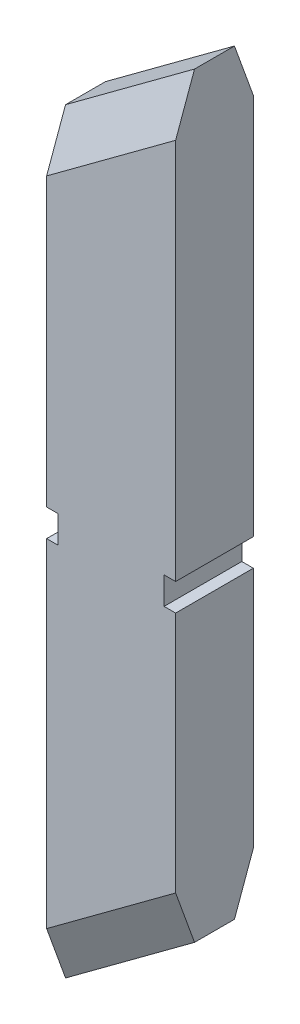
ISO-10303-21;
HEADER;
FILE_DESCRIPTION(('STEP AP214'),'2;1');
FILE_NAME('part.step','',(''),(''),'','','');
FILE_SCHEMA(('AUTOMOTIVE_DESIGN { 1 0 10303 214 1 1 1 1 }'));
ENDSEC;
DATA;
#1=APPLICATION_CONTEXT('core data for automotive mechanical design processes');
#2=APPLICATION_PROTOCOL_DEFINITION('international standard','automotive_design',2000,#1);
#3=PRODUCT_CONTEXT('',#1,'mechanical');
#4=PRODUCT('Part','Part','',(#3));
#5=PRODUCT_RELATED_PRODUCT_CATEGORY('part','',(#4));
#6=PRODUCT_DEFINITION_FORMATION('','',#4);
#7=PRODUCT_DEFINITION_CONTEXT('part definition',#1,'design');
#8=PRODUCT_DEFINITION('design','',#6,#7);
#9=PRODUCT_DEFINITION_SHAPE('','',#8);
#10=(LENGTH_UNIT() NAMED_UNIT(*) SI_UNIT(.MILLI.,.METRE.));
#11=(NAMED_UNIT(*) PLANE_ANGLE_UNIT() SI_UNIT($,.RADIAN.));
#12=(NAMED_UNIT(*) SI_UNIT($,.STERADIAN.) SOLID_ANGLE_UNIT());
#13=UNCERTAINTY_MEASURE_WITH_UNIT(LENGTH_MEASURE(1.E-05),#10,'distance_accuracy_value','');
#14=(GEOMETRIC_REPRESENTATION_CONTEXT(3) GLOBAL_UNCERTAINTY_ASSIGNED_CONTEXT((#13)) GLOBAL_UNIT_ASSIGNED_CONTEXT((#10,
#11,#12)) REPRESENTATION_CONTEXT('',''));
#15=CARTESIAN_POINT('',(0.,0.,0.));
#16=DIRECTION('',(0.,0.,1.));
#17=DIRECTION('',(1.,0.,0.));
#18=AXIS2_PLACEMENT_3D('',#15,#16,#17);
#19=CARTESIAN_POINT('',(2.93652173913044,23.3863043478261,3.7));
#20=DIRECTION('',(-1.,0.,0.));
#21=DIRECTION('',(0.,-1.,0.));
#22=AXIS2_PLACEMENT_3D('',#19,#20,#21);
#23=PLANE('',#22);
#24=DIRECTION('',(0.,0.,-1.));
#25=VECTOR('',#24,1.);
#26=CARTESIAN_POINT('',(2.93652173913044,2.71102614850869,59.784027911912));
#27=LINE('',#26,#25);
#28=CARTESIAN_POINT('',(2.93652173913044,2.71102614850869,3.7));
#29=VERTEX_POINT('',#28);
#30=CARTESIAN_POINT('',(2.93652173913044,2.71102614850869,0.));
#31=VERTEX_POINT('',#30);
#32=EDGE_CURVE('E174',#29,#31,#27,.T.);
#33=ORIENTED_EDGE('',*,*,#32,.T.);
#34=DIRECTION('',(0.,1.,0.));
#35=VECTOR('',#34,1.);
#36=CARTESIAN_POINT('',(2.93652173913044,23.3863043478261,0.));
#37=LINE('',#36,#35);
#38=CARTESIAN_POINT('',(2.93652173913044,20.8992870180739,0.));
#39=VERTEX_POINT('',#38);
#40=EDGE_CURVE('E208',#31,#39,#37,.T.);
#41=ORIENTED_EDGE('',*,*,#40,.T.);
#42=DIRECTION('',(0.,-0.9403229374053,-0.340283372190692));
#43=VECTOR('',#42,1.);
#44=CARTESIAN_POINT('',(2.93652173913044,23.3863043478261,0.900000000000001));
#45=LINE('',#44,#43);
#46=CARTESIAN_POINT('',(2.93652173913044,23.3863043478261,0.900000000000001));
#47=VERTEX_POINT('',#46);
#48=EDGE_CURVE('E240',#39,#47,#45,.F.);
#49=ORIENTED_EDGE('',*,*,#48,.T.);
#50=DIRECTION('',(0.,0.,-1.));
#51=VECTOR('',#50,1.);
#52=CARTESIAN_POINT('',(2.93652173913044,23.3863043478261,3.7));
#53=LINE('',#52,#51);
#54=CARTESIAN_POINT('',(2.93652173913044,23.3863043478261,2.8));
#55=VERTEX_POINT('',#54);
#56=EDGE_CURVE('E204',#55,#47,#53,.T.);
#57=ORIENTED_EDGE('',*,*,#56,.F.);
#58=DIRECTION('',(0.,-0.9403229374053,0.340283372190692));
#59=VECTOR('',#58,1.);
#60=CARTESIAN_POINT('',(2.93652173913044,13.1294252449321,6.51175185720331));
#61=LINE('',#60,#59);
#62=CARTESIAN_POINT('',(2.93652173913044,20.8992870180739,3.7));
#63=VERTEX_POINT('',#62);
#64=EDGE_CURVE('E229',#55,#63,#61,.T.);
#65=ORIENTED_EDGE('',*,*,#64,.T.);
#66=DIRECTION('',(0.,1.,0.));
#67=VECTOR('',#66,1.);
#68=CARTESIAN_POINT('',(2.93652173913044,23.3863043478261,3.7));
#69=LINE('',#68,#67);
#70=EDGE_CURVE('E200',#29,#63,#69,.T.);
#71=ORIENTED_EDGE('',*,*,#70,.F.);
#72=EDGE_LOOP('',(#33,#41,#49,#57,#65,#71));
#73=FACE_BOUND('',#72,.T.);
#74=ADVANCED_FACE('F39',(#73),#23,.F.);
#75=DIRECTION('',(0.,0.,-1.));
#76=VECTOR('',#75,1.);
#77=CARTESIAN_POINT('',(2.93652173913044,1.41102614850869,59.784027911912));
#78=LINE('',#77,#76);
#79=CARTESIAN_POINT('',(2.93652173913044,1.41102614850869,3.7));
#80=VERTEX_POINT('',#79);
#81=CARTESIAN_POINT('',(2.93652173913044,1.41102614850869,0.));
#82=VERTEX_POINT('',#81);
#83=EDGE_CURVE('E165',#80,#82,#78,.T.);
#84=ORIENTED_EDGE('',*,*,#83,.F.);
#85=CARTESIAN_POINT('',(2.93652173913044,-10.1266783224216,3.70000000000001));
#86=VERTEX_POINT('',#85);
#87=EDGE_CURVE('E202',#86,#80,#69,.T.);
#88=ORIENTED_EDGE('',*,*,#87,.F.);
#89=DIRECTION('',(0.,-0.9403229374053,-0.340283372190692));
#90=VECTOR('',#89,1.);
#91=CARTESIAN_POINT('',(2.93652173913044,-8.20430584182602,4.3956667377579));
#92=LINE('',#91,#90);
#93=CARTESIAN_POINT('',(2.93652173913044,-12.6136956521739,2.8));
#94=VERTEX_POINT('',#93);
#95=EDGE_CURVE('E245',#86,#94,#92,.T.);
#96=ORIENTED_EDGE('',*,*,#95,.T.);
#97=DIRECTION('',(0.,0.,-1.));
#98=VECTOR('',#97,1.);
#99=CARTESIAN_POINT('',(2.93652173913044,-12.6136956521739,3.7));
#100=LINE('',#99,#98);
#101=CARTESIAN_POINT('',(2.93652173913044,-12.6136956521739,0.899999999999998));
#102=VERTEX_POINT('',#101);
#103=EDGE_CURVE('E213',#94,#102,#100,.T.);
#104=ORIENTED_EDGE('',*,*,#103,.T.);
#105=DIRECTION('',(0.,-0.940322937405299,0.340283372190693));
#106=VECTOR('',#105,1.);
#107=CARTESIAN_POINT('',(2.93652173913044,-12.6136956521739,0.899999999999998));
#108=LINE('',#107,#106);
#109=CARTESIAN_POINT('',(2.93652173913044,-10.1266783224217,0.));
#110=VERTEX_POINT('',#109);
#111=EDGE_CURVE('E255',#102,#110,#108,.F.);
#112=ORIENTED_EDGE('',*,*,#111,.T.);
#113=EDGE_CURVE('E209',#110,#82,#37,.T.);
#114=ORIENTED_EDGE('',*,*,#113,.T.);
#115=EDGE_LOOP('',(#84,#88,#96,#104,#112,#114));
#116=FACE_BOUND('',#115,.T.);
#117=ADVANCED_FACE('F311',(#116),#23,.F.);
#118=CARTESIAN_POINT('',(0.,0.,3.7));
#119=DIRECTION('',(0.,0.,1.));
#120=DIRECTION('',(1.,0.,0.));
#121=AXIS2_PLACEMENT_3D('',#118,#119,#120);
#122=PLANE('',#121);
#123=DIRECTION('',(0.,1.,0.));
#124=VECTOR('',#123,1.);
#125=CARTESIAN_POINT('',(2.38652173913044,0.,3.7));
#126=LINE('',#125,#124);
#127=CARTESIAN_POINT('',(2.38652173913044,1.41102614850869,3.7));
#128=VERTEX_POINT('',#127);
#129=CARTESIAN_POINT('',(2.38652173913044,2.71102614850869,3.7));
#130=VERTEX_POINT('',#129);
#131=EDGE_CURVE('E54',#128,#130,#126,.T.);
#132=ORIENTED_EDGE('',*,*,#131,.T.);
#133=DIRECTION('',(1.,0.,0.));
#134=VECTOR('',#133,1.);
#135=CARTESIAN_POINT('',(0.,2.7110261485087,3.7));
#136=LINE('',#135,#134);
#137=EDGE_CURVE('E178',#130,#29,#136,.T.);
#138=ORIENTED_EDGE('',*,*,#137,.T.);
#139=ORIENTED_EDGE('',*,*,#70,.T.);
#140=DIRECTION('',(-0.804176141466327,-0.594391061083804,0.));
#141=VECTOR('',#140,1.);
#142=CARTESIAN_POINT('',(-2.01469613870194,17.2396911953282,3.7));
#143=LINE('',#142,#141);
#144=CARTESIAN_POINT('',(-3.20347826086956,16.3610261485087,3.7));
#145=VERTEX_POINT('',#144);
#146=EDGE_CURVE('E222',#63,#145,#143,.T.);
#147=ORIENTED_EDGE('',*,*,#146,.T.);
#148=DIRECTION('',(0.,-1.,0.));
#149=VECTOR('',#148,1.);
#150=CARTESIAN_POINT('',(-3.20347826086956,18.8480434782609,3.7));
#151=LINE('',#150,#149);
#152=CARTESIAN_POINT('',(-3.20347826086956,2.71102614850869,3.7));
#153=VERTEX_POINT('',#152);
#154=EDGE_CURVE('E197',#145,#153,#151,.T.);
#155=ORIENTED_EDGE('',*,*,#154,.T.);
#156=DIRECTION('',(-1.,0.,0.));
#157=VECTOR('',#156,1.);
#158=CARTESIAN_POINT('',(0.,2.71102614850869,3.7));
#159=LINE('',#158,#157);
#160=CARTESIAN_POINT('',(-2.65347826086956,2.71102614850869,3.7));
#161=VERTEX_POINT('',#160);
#162=EDGE_CURVE('E194',#161,#153,#159,.T.);
#163=ORIENTED_EDGE('',*,*,#162,.F.);
#164=DIRECTION('',(0.,1.,0.));
#165=VECTOR('',#164,1.);
#166=CARTESIAN_POINT('',(-2.65347826086956,0.,3.7));
#167=LINE('',#166,#165);
#168=CARTESIAN_POINT('',(-2.65347826086956,1.41102614850869,3.7));
#169=VERTEX_POINT('',#168);
#170=EDGE_CURVE('E192',#169,#161,#167,.T.);
#171=ORIENTED_EDGE('',*,*,#170,.F.);
#172=DIRECTION('',(1.,0.,0.));
#173=VECTOR('',#172,1.);
#174=CARTESIAN_POINT('',(0.,1.41102614850869,3.7));
#175=LINE('',#174,#173);
#176=CARTESIAN_POINT('',(-3.20347826086956,1.41102614850869,3.7));
#177=VERTEX_POINT('',#176);
#178=EDGE_CURVE('E190',#177,#169,#175,.T.);
#179=ORIENTED_EDGE('',*,*,#178,.F.);
#180=CARTESIAN_POINT('',(-3.20347826086956,-14.6649391919868,3.70000000000001));
#181=VERTEX_POINT('',#180);
#182=EDGE_CURVE('E201',#177,#181,#151,.T.);
#183=ORIENTED_EDGE('',*,*,#182,.T.);
#184=DIRECTION('',(0.804176141466327,0.594391061083804,0.));
#185=VECTOR('',#184,1.);
#186=CARTESIAN_POINT('',(1.74773961696281,-11.0053433692412,3.7));
#187=LINE('',#186,#185);
#188=EDGE_CURVE('E242',#181,#86,#187,.T.);
#189=ORIENTED_EDGE('',*,*,#188,.T.);
#190=ORIENTED_EDGE('',*,*,#87,.T.);
#191=DIRECTION('',(-1.,0.,0.));
#192=VECTOR('',#191,1.);
#193=CARTESIAN_POINT('',(0.,1.4110261485087,3.7));
#194=LINE('',#193,#192);
#195=EDGE_CURVE('E59',#80,#128,#194,.T.);
#196=ORIENTED_EDGE('',*,*,#195,.T.);
#197=EDGE_LOOP('',(#132,#138,#139,#147,#155,#163,#171,#179,#183,#189,#190,#196));
#198=FACE_BOUND('',#197,.T.);
#199=ADVANCED_FACE('F293',(#198),#122,.T.);
#200=CARTESIAN_POINT('',(0.,0.,0.));
#201=DIRECTION('',(0.,0.,1.));
#202=DIRECTION('',(1.,0.,0.));
#203=AXIS2_PLACEMENT_3D('',#200,#201,#202);
#204=PLANE('',#203);
#205=DIRECTION('',(1.,0.,0.));
#206=VECTOR('',#205,1.);
#207=CARTESIAN_POINT('',(0.,2.7110261485087,0.));
#208=LINE('',#207,#206);
#209=CARTESIAN_POINT('',(2.38652173913044,2.71102614850869,0.));
#210=VERTEX_POINT('',#209);
#211=EDGE_CURVE('E11',#210,#31,#208,.T.);
#212=ORIENTED_EDGE('',*,*,#211,.F.);
#213=DIRECTION('',(0.,1.,0.));
#214=VECTOR('',#213,1.);
#215=CARTESIAN_POINT('',(2.38652173913044,0.,0.));
#216=LINE('',#215,#214);
#217=CARTESIAN_POINT('',(2.38652173913044,1.41102614850869,0.));
#218=VERTEX_POINT('',#217);
#219=EDGE_CURVE('E47',#218,#210,#216,.T.);
#220=ORIENTED_EDGE('',*,*,#219,.F.);
#221=DIRECTION('',(-1.,0.,0.));
#222=VECTOR('',#221,1.);
#223=CARTESIAN_POINT('',(0.,1.4110261485087,0.));
#224=LINE('',#223,#222);
#225=EDGE_CURVE('E153',#82,#218,#224,.T.);
#226=ORIENTED_EDGE('',*,*,#225,.F.);
#227=ORIENTED_EDGE('',*,*,#113,.F.);
#228=DIRECTION('',(-0.804176141466327,-0.594391061083804,0.));
#229=VECTOR('',#228,1.);
#230=CARTESIAN_POINT('',(5.87797800327087,-7.95255847501356,0.));
#231=LINE('',#230,#229);
#232=CARTESIAN_POINT('',(-3.20347826086956,-14.6649391919869,0.));
#233=VERTEX_POINT('',#232);
#234=EDGE_CURVE('E257',#110,#233,#231,.T.);
#235=ORIENTED_EDGE('',*,*,#234,.T.);
#236=DIRECTION('',(0.,-1.,0.));
#237=VECTOR('',#236,1.);
#238=CARTESIAN_POINT('',(-3.20347826086956,18.8480434782609,0.));
#239=LINE('',#238,#237);
#240=CARTESIAN_POINT('',(-3.20347826086956,1.41102614850869,0.));
#241=VERTEX_POINT('',#240);
#242=EDGE_CURVE('E196',#241,#233,#239,.T.);
#243=ORIENTED_EDGE('',*,*,#242,.F.);
#244=DIRECTION('',(1.,0.,0.));
#245=VECTOR('',#244,1.);
#246=CARTESIAN_POINT('',(0.,1.41102614850869,0.));
#247=LINE('',#246,#245);
#248=CARTESIAN_POINT('',(-2.65347826086956,1.41102614850869,0.));
#249=VERTEX_POINT('',#248);
#250=EDGE_CURVE('E262',#241,#249,#247,.T.);
#251=ORIENTED_EDGE('',*,*,#250,.T.);
#252=DIRECTION('',(0.,1.,0.));
#253=VECTOR('',#252,1.);
#254=CARTESIAN_POINT('',(-2.65347826086956,0.,0.));
#255=LINE('',#254,#253);
#256=CARTESIAN_POINT('',(-2.65347826086956,2.71102614850869,0.));
#257=VERTEX_POINT('',#256);
#258=EDGE_CURVE('E265',#249,#257,#255,.T.);
#259=ORIENTED_EDGE('',*,*,#258,.T.);
#260=DIRECTION('',(-1.,0.,0.));
#261=VECTOR('',#260,1.);
#262=CARTESIAN_POINT('',(0.,2.71102614850869,0.));
#263=LINE('',#262,#261);
#264=CARTESIAN_POINT('',(-3.20347826086956,2.71102614850869,0.));
#265=VERTEX_POINT('',#264);
#266=EDGE_CURVE('E166',#257,#265,#263,.T.);
#267=ORIENTED_EDGE('',*,*,#266,.T.);
#268=CARTESIAN_POINT('',(-3.20347826086956,16.3610261485087,0.));
#269=VERTEX_POINT('',#268);
#270=EDGE_CURVE('E205',#269,#265,#239,.T.);
#271=ORIENTED_EDGE('',*,*,#270,.F.);
#272=DIRECTION('',(0.804176141466327,0.594391061083804,0.));
#273=VECTOR('',#272,1.);
#274=CARTESIAN_POINT('',(-8.95228171327408,12.1119105532532,0.));
#275=LINE('',#274,#273);
#276=EDGE_CURVE('E237',#269,#39,#275,.T.);
#277=ORIENTED_EDGE('',*,*,#276,.T.);
#278=ORIENTED_EDGE('',*,*,#40,.F.);
#279=EDGE_LOOP('',(#212,#220,#226,#227,#235,#243,#251,#259,#267,#271,#277,#278));
#280=FACE_BOUND('',#279,.T.);
#281=ADVANCED_FACE('F151',(#280),#204,.F.);
#282=CARTESIAN_POINT('',(-3.20347826086956,18.8480434782609,3.7));
#283=DIRECTION('',(1.,0.,0.));
#284=DIRECTION('',(0.,0.,-1.));
#285=AXIS2_PLACEMENT_3D('',#282,#283,#284);
#286=PLANE('',#285);
#287=ORIENTED_EDGE('',*,*,#270,.T.);
#288=DIRECTION('',(0.,0.,-1.));
#289=VECTOR('',#288,1.);
#290=CARTESIAN_POINT('',(-3.20347826086956,2.71102614850869,58.659027911912));
#291=LINE('',#290,#289);
#292=EDGE_CURVE('E188',#153,#265,#291,.T.);
#293=ORIENTED_EDGE('',*,*,#292,.F.);
#294=ORIENTED_EDGE('',*,*,#154,.F.);
#295=DIRECTION('',(0.,0.9403229374053,-0.340283372190692));
#296=VECTOR('',#295,1.);
#297=CARTESIAN_POINT('',(-3.20347826086956,12.6039274324803,5.05961611685371));
#298=LINE('',#297,#296);
#299=CARTESIAN_POINT('',(-3.20347826086956,18.8480434782609,2.8));
#300=VERTEX_POINT('',#299);
#301=EDGE_CURVE('E225',#145,#300,#298,.T.);
#302=ORIENTED_EDGE('',*,*,#301,.T.);
#303=DIRECTION('',(0.,0.,-1.));
#304=VECTOR('',#303,1.);
#305=CARTESIAN_POINT('',(-3.20347826086956,18.8480434782609,3.7));
#306=LINE('',#305,#304);
#307=CARTESIAN_POINT('',(-3.20347826086956,18.8480434782609,0.900000000000001));
#308=VERTEX_POINT('',#307);
#309=EDGE_CURVE('E219',#300,#308,#306,.T.);
#310=ORIENTED_EDGE('',*,*,#309,.T.);
#311=DIRECTION('',(0.,0.9403229374053,0.340283372190692));
#312=VECTOR('',#311,1.);
#313=CARTESIAN_POINT('',(-3.20347826086956,22.8608065353742,2.3521357403496));
#314=LINE('',#313,#312);
#315=EDGE_CURVE('E235',#308,#269,#314,.F.);
#316=ORIENTED_EDGE('',*,*,#315,.T.);
#317=EDGE_LOOP('',(#287,#293,#294,#302,#310,#316));
#318=FACE_BOUND('',#317,.T.);
#319=ADVANCED_FACE('F276',(#318),#286,.F.);
#320=CARTESIAN_POINT('',(2.93652173913044,23.3863043478261,3.7));
#321=DIRECTION('',(0.594391061083804,-0.804176141466327,0.));
#322=DIRECTION('',(0.804176141466327,0.594391061083804,0.));
#323=AXIS2_PLACEMENT_3D('',#320,#321,#322);
#324=PLANE('',#323);
#325=ORIENTED_EDGE('',*,*,#56,.T.);
#326=DIRECTION('',(-0.804176141466327,-0.594391061083804,0.));
#327=VECTOR('',#326,1.);
#328=CARTESIAN_POINT('',(2.93652173913044,23.3863043478261,0.900000000000001));
#329=LINE('',#328,#327);
#330=EDGE_CURVE('E232',#47,#308,#329,.T.);
#331=ORIENTED_EDGE('',*,*,#330,.T.);
#332=ORIENTED_EDGE('',*,*,#309,.F.);
#333=DIRECTION('',(0.804176141466327,0.594391061083804,0.));
#334=VECTOR('',#333,1.);
#335=CARTESIAN_POINT('',(2.93652173913044,23.3863043478261,2.8));
#336=LINE('',#335,#334);
#337=EDGE_CURVE('E227',#300,#55,#336,.T.);
#338=ORIENTED_EDGE('',*,*,#337,.T.);
#339=EDGE_LOOP('',(#325,#331,#332,#338));
#340=FACE_BOUND('',#339,.T.);
#341=ADVANCED_FACE('F284',(#340),#324,.F.);
#342=ORIENTED_EDGE('',*,*,#182,.F.);
#343=DIRECTION('',(0.,0.,-1.));
#344=VECTOR('',#343,1.);
#345=CARTESIAN_POINT('',(-3.20347826086956,1.41102614850869,58.659027911912));
#346=LINE('',#345,#344);
#347=EDGE_CURVE('E181',#177,#241,#346,.T.);
#348=ORIENTED_EDGE('',*,*,#347,.T.);
#349=ORIENTED_EDGE('',*,*,#242,.T.);
#350=DIRECTION('',(0.,0.940322937405299,-0.340283372190693));
#351=VECTOR('',#350,1.);
#352=CARTESIAN_POINT('',(-3.20347826086956,-13.1391934646258,-0.552135740349609));
#353=LINE('',#352,#351);
#354=CARTESIAN_POINT('',(-3.20347826086956,-17.1519565217391,0.899999999999997));
#355=VERTEX_POINT('',#354);
#356=EDGE_CURVE('E260',#233,#355,#353,.F.);
#357=ORIENTED_EDGE('',*,*,#356,.T.);
#358=DIRECTION('',(0.,0.,-1.));
#359=VECTOR('',#358,1.);
#360=CARTESIAN_POINT('',(-3.20347826086956,-17.1519565217391,3.7));
#361=LINE('',#360,#359);
#362=CARTESIAN_POINT('',(-3.20347826086956,-17.1519565217391,2.8));
#363=VERTEX_POINT('',#362);
#364=EDGE_CURVE('E216',#363,#355,#361,.T.);
#365=ORIENTED_EDGE('',*,*,#364,.F.);
#366=DIRECTION('',(0.,0.9403229374053,0.340283372190692));
#367=VECTOR('',#366,1.);
#368=CARTESIAN_POINT('',(-3.20347826086956,-8.72980365427788,5.84780247810751));
#369=LINE('',#368,#367);
#370=EDGE_CURVE('E249',#363,#181,#369,.T.);
#371=ORIENTED_EDGE('',*,*,#370,.T.);
#372=EDGE_LOOP('',(#342,#348,#349,#357,#365,#371));
#373=FACE_BOUND('',#372,.T.);
#374=ADVANCED_FACE('F323',(#373),#286,.F.);
#375=CARTESIAN_POINT('',(2.93652173913044,-12.6136956521739,3.7));
#376=DIRECTION('',(-0.594391061083805,0.804176141466327,0.));
#377=DIRECTION('',(-0.804176141466326,-0.594391061083804,0.));
#378=AXIS2_PLACEMENT_3D('',#375,#376,#377);
#379=PLANE('',#378);
#380=ORIENTED_EDGE('',*,*,#364,.T.);
#381=DIRECTION('',(0.804176141466326,0.594391061083804,0.));
#382=VECTOR('',#381,1.);
#383=CARTESIAN_POINT('',(2.93652173913044,-12.6136956521739,0.899999999999998));
#384=LINE('',#383,#382);
#385=EDGE_CURVE('E252',#355,#102,#384,.T.);
#386=ORIENTED_EDGE('',*,*,#385,.T.);
#387=ORIENTED_EDGE('',*,*,#103,.F.);
#388=DIRECTION('',(-0.804176141466326,-0.594391061083804,0.));
#389=VECTOR('',#388,1.);
#390=CARTESIAN_POINT('',(-3.20347826086956,-17.1519565217391,2.8));
#391=LINE('',#390,#389);
#392=EDGE_CURVE('E247',#94,#363,#391,.T.);
#393=ORIENTED_EDGE('',*,*,#392,.T.);
#394=EDGE_LOOP('',(#380,#386,#387,#393));
#395=FACE_BOUND('',#394,.T.);
#396=ADVANCED_FACE('F320',(#395),#379,.F.);
#397=CARTESIAN_POINT('',(-8.95228171327408,12.1119105532532,3.7));
#398=DIRECTION('',(-0.243917095988776,0.330005482808345,0.911921505175108));
#399=DIRECTION('',(0.804176141466327,0.594391061083804,0.));
#400=AXIS2_PLACEMENT_3D('',#397,#398,#399);
#401=PLANE('',#400);
#402=ORIENTED_EDGE('',*,*,#64,.F.);
#403=ORIENTED_EDGE('',*,*,#337,.F.);
#404=ORIENTED_EDGE('',*,*,#301,.F.);
#405=ORIENTED_EDGE('',*,*,#146,.F.);
#406=EDGE_LOOP('',(#402,#403,#404,#405));
#407=FACE_BOUND('',#406,.T.);
#408=ADVANCED_FACE('F292',(#407),#401,.T.);
#409=CARTESIAN_POINT('',(2.93652173913044,23.3863043478261,0.900000000000001));
#410=DIRECTION('',(0.243917095988776,-0.330005482808345,0.911921505175108));
#411=DIRECTION('',(-0.804176141466327,-0.594391061083804,0.));
#412=AXIS2_PLACEMENT_3D('',#409,#410,#411);
#413=PLANE('',#412);
#414=ORIENTED_EDGE('',*,*,#48,.F.);
#415=ORIENTED_EDGE('',*,*,#276,.F.);
#416=ORIENTED_EDGE('',*,*,#315,.F.);
#417=ORIENTED_EDGE('',*,*,#330,.F.);
#418=EDGE_LOOP('',(#414,#415,#416,#417));
#419=FACE_BOUND('',#418,.T.);
#420=ADVANCED_FACE('F282',(#419),#413,.F.);
#421=CARTESIAN_POINT('',(5.87797800327086,-7.95255847501354,3.7));
#422=DIRECTION('',(0.243917095988776,-0.330005482808345,0.911921505175108));
#423=DIRECTION('',(-0.804176141466326,-0.594391061083804,0.));
#424=AXIS2_PLACEMENT_3D('',#421,#422,#423);
#425=PLANE('',#424);
#426=ORIENTED_EDGE('',*,*,#370,.F.);
#427=ORIENTED_EDGE('',*,*,#392,.F.);
#428=ORIENTED_EDGE('',*,*,#95,.F.);
#429=ORIENTED_EDGE('',*,*,#188,.F.);
#430=EDGE_LOOP('',(#426,#427,#428,#429));
#431=FACE_BOUND('',#430,.T.);
#432=ADVANCED_FACE('F333',(#431),#425,.T.);
#433=CARTESIAN_POINT('',(2.93652173913044,-12.6136956521739,0.899999999999998));
#434=DIRECTION('',(-0.243917095988776,0.330005482808346,0.911921505175107));
#435=DIRECTION('',(0.804176141466326,0.594391061083804,0.));
#436=AXIS2_PLACEMENT_3D('',#433,#434,#435);
#437=PLANE('',#436);
#438=ORIENTED_EDGE('',*,*,#356,.F.);
#439=ORIENTED_EDGE('',*,*,#234,.F.);
#440=ORIENTED_EDGE('',*,*,#111,.F.);
#441=ORIENTED_EDGE('',*,*,#385,.F.);
#442=EDGE_LOOP('',(#438,#439,#440,#441));
#443=FACE_BOUND('',#442,.T.);
#444=ADVANCED_FACE('F41',(#443),#437,.F.);
#445=CARTESIAN_POINT('',(-3.20347826086956,2.71102614850869,58.659027911912));
#446=DIRECTION('',(0.,1.,0.));
#447=DIRECTION('',(0.,0.,1.));
#448=AXIS2_PLACEMENT_3D('',#445,#446,#447);
#449=PLANE('',#448);
#450=DIRECTION('',(0.,0.,-1.));
#451=VECTOR('',#450,1.);
#452=CARTESIAN_POINT('',(-2.65347826086956,2.71102614850869,58.659027911912));
#453=LINE('',#452,#451);
#454=EDGE_CURVE('E184',#161,#257,#453,.T.);
#455=ORIENTED_EDGE('',*,*,#454,.F.);
#456=ORIENTED_EDGE('',*,*,#162,.T.);
#457=ORIENTED_EDGE('',*,*,#292,.T.);
#458=ORIENTED_EDGE('',*,*,#266,.F.);
#459=EDGE_LOOP('',(#455,#456,#457,#458));
#460=FACE_BOUND('',#459,.T.);
#461=ADVANCED_FACE('F339',(#460),#449,.F.);
#462=CARTESIAN_POINT('',(-2.65347826086956,2.71102614850869,58.659027911912));
#463=DIRECTION('',(1.,0.,0.));
#464=DIRECTION('',(0.,0.,-1.));
#465=AXIS2_PLACEMENT_3D('',#462,#463,#464);
#466=PLANE('',#465);
#467=DIRECTION('',(0.,0.,-1.));
#468=VECTOR('',#467,1.);
#469=CARTESIAN_POINT('',(-2.65347826086956,1.41102614850869,58.659027911912));
#470=LINE('',#469,#468);
#471=EDGE_CURVE('E180',#169,#249,#470,.T.);
#472=ORIENTED_EDGE('',*,*,#471,.F.);
#473=ORIENTED_EDGE('',*,*,#170,.T.);
#474=ORIENTED_EDGE('',*,*,#454,.T.);
#475=ORIENTED_EDGE('',*,*,#258,.F.);
#476=EDGE_LOOP('',(#472,#473,#474,#475));
#477=FACE_BOUND('',#476,.T.);
#478=ADVANCED_FACE('F307',(#477),#466,.F.);
#479=CARTESIAN_POINT('',(-2.65347826086956,1.41102614850869,58.659027911912));
#480=DIRECTION('',(0.,-1.,0.));
#481=DIRECTION('',(0.,0.,-1.));
#482=AXIS2_PLACEMENT_3D('',#479,#480,#481);
#483=PLANE('',#482);
#484=ORIENTED_EDGE('',*,*,#347,.F.);
#485=ORIENTED_EDGE('',*,*,#178,.T.);
#486=ORIENTED_EDGE('',*,*,#471,.T.);
#487=ORIENTED_EDGE('',*,*,#250,.F.);
#488=EDGE_LOOP('',(#484,#485,#486,#487));
#489=FACE_BOUND('',#488,.T.);
#490=ADVANCED_FACE('F299',(#489),#483,.F.);
#491=CARTESIAN_POINT('',(2.93652173913044,2.71102614850869,59.784027911912));
#492=DIRECTION('',(0.,-1.,0.));
#493=DIRECTION('',(1.,0.,0.));
#494=AXIS2_PLACEMENT_3D('',#491,#492,#493);
#495=PLANE('',#494);
#496=ORIENTED_EDGE('',*,*,#137,.F.);
#497=DIRECTION('',(0.,0.,-1.));
#498=VECTOR('',#497,1.);
#499=CARTESIAN_POINT('',(2.38652173913044,2.71102614850869,59.784027911912));
#500=LINE('',#499,#498);
#501=EDGE_CURVE('E170',#130,#210,#500,.T.);
#502=ORIENTED_EDGE('',*,*,#501,.T.);
#503=ORIENTED_EDGE('',*,*,#211,.T.);
#504=ORIENTED_EDGE('',*,*,#32,.F.);
#505=EDGE_LOOP('',(#496,#502,#503,#504));
#506=FACE_BOUND('',#505,.T.);
#507=ADVANCED_FACE('F297',(#506),#495,.T.);
#508=CARTESIAN_POINT('',(2.38652173913044,2.71102614850869,59.784027911912));
#509=DIRECTION('',(1.,0.,0.));
#510=DIRECTION('',(0.,1.,0.));
#511=AXIS2_PLACEMENT_3D('',#508,#509,#510);
#512=PLANE('',#511);
#513=ORIENTED_EDGE('',*,*,#131,.F.);
#514=DIRECTION('',(0.,0.,-1.));
#515=VECTOR('',#514,1.);
#516=CARTESIAN_POINT('',(2.38652173913044,1.41102614850869,59.784027911912));
#517=LINE('',#516,#515);
#518=EDGE_CURVE('E164',#128,#218,#517,.T.);
#519=ORIENTED_EDGE('',*,*,#518,.T.);
#520=ORIENTED_EDGE('',*,*,#219,.T.);
#521=ORIENTED_EDGE('',*,*,#501,.F.);
#522=EDGE_LOOP('',(#513,#519,#520,#521));
#523=FACE_BOUND('',#522,.T.);
#524=ADVANCED_FACE('F168',(#523),#512,.T.);
#525=CARTESIAN_POINT('',(2.38652173913044,1.41102614850869,59.784027911912));
#526=DIRECTION('',(0.,1.,0.));
#527=DIRECTION('',(-1.,0.,0.));
#528=AXIS2_PLACEMENT_3D('',#525,#526,#527);
#529=PLANE('',#528);
#530=ORIENTED_EDGE('',*,*,#195,.F.);
#531=ORIENTED_EDGE('',*,*,#83,.T.);
#532=ORIENTED_EDGE('',*,*,#225,.T.);
#533=ORIENTED_EDGE('',*,*,#518,.F.);
#534=EDGE_LOOP('',(#530,#531,#532,#533));
#535=FACE_BOUND('',#534,.T.);
#536=ADVANCED_FACE('F163',(#535),#529,.T.);
#537=CLOSED_SHELL('',(#74,#117,#199,#281,#319,#341,#374,#396,#408,#420,#432,#444,#461,#478,#490,
#507,#524,#536));
#538=MANIFOLD_SOLID_BREP('B2',#537);
#539=ADVANCED_BREP_SHAPE_REPRESENTATION('',(#18,#538),#14);
#540=SHAPE_DEFINITION_REPRESENTATION(#9,#539);
ENDSEC;
END-ISO-10303-21;
